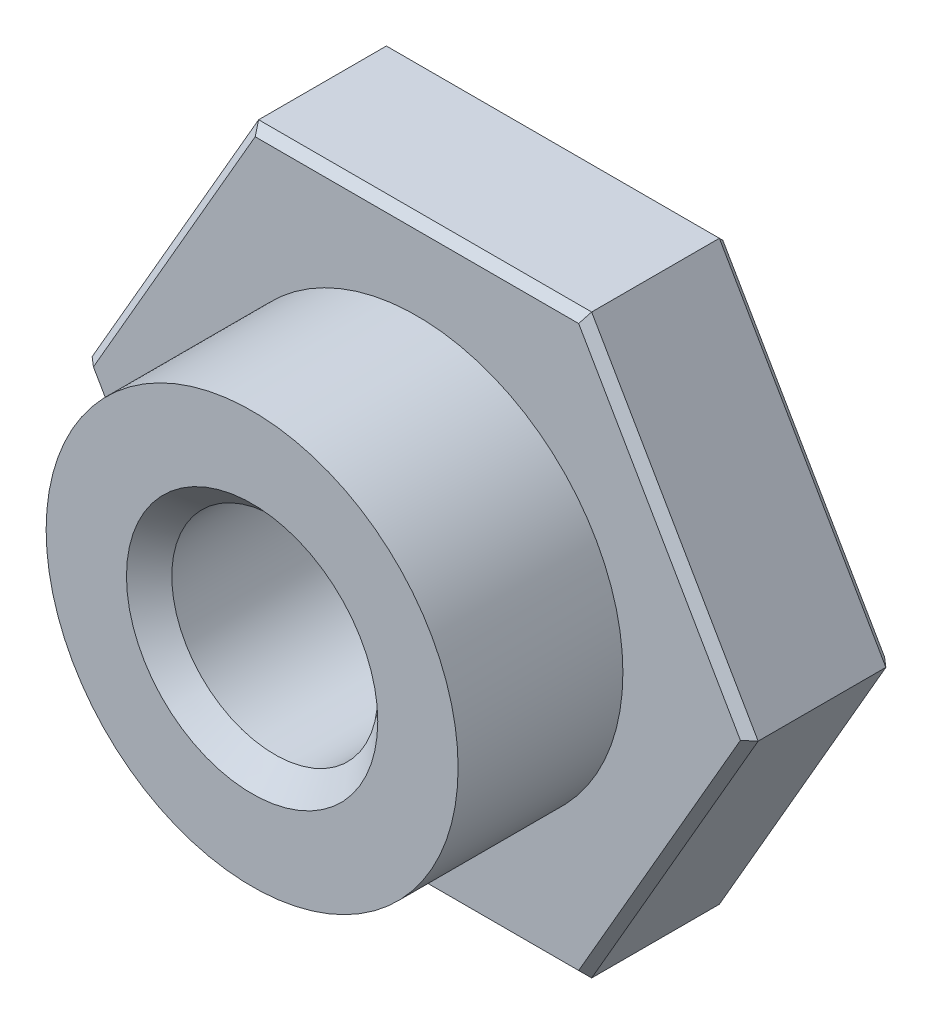
ISO-10303-21;
HEADER;
FILE_DESCRIPTION(('STEP AP214'),'2;1');
FILE_NAME('part.step','',(''),(''),'','','');
FILE_SCHEMA(('AUTOMOTIVE_DESIGN { 1 0 10303 214 1 1 1 1 }'));
ENDSEC;
DATA;
#1=APPLICATION_CONTEXT('core data for automotive mechanical design processes');
#2=APPLICATION_PROTOCOL_DEFINITION('international standard','automotive_design',2000,#1);
#3=PRODUCT_CONTEXT('',#1,'mechanical');
#4=PRODUCT('Part','Part','',(#3));
#5=PRODUCT_RELATED_PRODUCT_CATEGORY('part','',(#4));
#6=PRODUCT_DEFINITION_FORMATION('','',#4);
#7=PRODUCT_DEFINITION_CONTEXT('part definition',#1,'design');
#8=PRODUCT_DEFINITION('design','',#6,#7);
#9=PRODUCT_DEFINITION_SHAPE('','',#8);
#10=(LENGTH_UNIT() NAMED_UNIT(*) SI_UNIT(.MILLI.,.METRE.));
#11=(NAMED_UNIT(*) PLANE_ANGLE_UNIT() SI_UNIT($,.RADIAN.));
#12=(NAMED_UNIT(*) SI_UNIT($,.STERADIAN.) SOLID_ANGLE_UNIT());
#13=UNCERTAINTY_MEASURE_WITH_UNIT(LENGTH_MEASURE(1.E-05),#10,'distance_accuracy_value','');
#14=(GEOMETRIC_REPRESENTATION_CONTEXT(3) GLOBAL_UNCERTAINTY_ASSIGNED_CONTEXT((#13)) GLOBAL_UNIT_ASSIGNED_CONTEXT((#10,
#11,#12)) REPRESENTATION_CONTEXT('',''));
#15=CARTESIAN_POINT('',(0.,0.,0.));
#16=DIRECTION('',(0.,0.,1.));
#17=DIRECTION('',(1.,0.,0.));
#18=AXIS2_PLACEMENT_3D('',#15,#16,#17);
#19=CARTESIAN_POINT('',(0.,0.,3.75));
#20=DIRECTION('',(0.,0.,-1.));
#21=DIRECTION('',(-1.,0.,0.));
#22=AXIS2_PLACEMENT_3D('',#19,#20,#21);
#23=CYLINDRICAL_SURFACE('',#22,2.5);
#24=CARTESIAN_POINT('',(0.,0.,1.75));
#25=DIRECTION('',(0.,0.,-1.));
#26=DIRECTION('',(-1.,0.,0.));
#27=AXIS2_PLACEMENT_3D('',#24,#25,#26);
#28=CIRCLE('',#27,2.5);
#29=CARTESIAN_POINT('',(-2.5,0.,1.75));
#30=VERTEX_POINT('',#29);
#31=EDGE_CURVE('E20',#30,#30,#28,.T.);
#32=ORIENTED_EDGE('',*,*,#31,.F.);
#33=EDGE_LOOP('',(#32));
#34=FACE_BOUND('',#33,.T.);
#35=CARTESIAN_POINT('',(0.,0.,3.75));
#36=DIRECTION('',(0.,0.,-1.));
#37=DIRECTION('',(-1.,0.,0.));
#38=AXIS2_PLACEMENT_3D('',#35,#36,#37);
#39=CIRCLE('',#38,2.5);
#40=CARTESIAN_POINT('',(-2.5,0.,3.75));
#41=VERTEX_POINT('',#40);
#42=EDGE_CURVE('E117',#41,#41,#39,.F.);
#43=ORIENTED_EDGE('',*,*,#42,.F.);
#44=EDGE_LOOP('',(#43));
#45=FACE_BOUND('',#44,.T.);
#46=ADVANCED_FACE('F17',(#34,#45),#23,.T.);
#47=CARTESIAN_POINT('',(0.,0.,1.75));
#48=DIRECTION('',(0.,0.,1.));
#49=DIRECTION('',(1.,0.,0.));
#50=AXIS2_PLACEMENT_3D('',#47,#48,#49);
#51=PLANE('',#50);
#52=ORIENTED_EDGE('',*,*,#31,.T.);
#53=EDGE_LOOP('',(#52));
#54=FACE_BOUND('',#53,.T.);
#55=DIRECTION('',(1.,0.,0.));
#56=VECTOR('',#55,1.);
#57=CARTESIAN_POINT('',(0.,-3.4,1.75));
#58=LINE('',#57,#56);
#59=CARTESIAN_POINT('',(1.96299091524473,-3.4,1.75));
#60=VERTEX_POINT('',#59);
#61=CARTESIAN_POINT('',(-1.96299091524473,-3.4,1.75));
#62=VERTEX_POINT('',#61);
#63=EDGE_CURVE('E111',#60,#62,#58,.F.);
#64=ORIENTED_EDGE('',*,*,#63,.F.);
#65=DIRECTION('',(-0.5,-0.866025403784438,0.));
#66=VECTOR('',#65,1.);
#67=CARTESIAN_POINT('',(3.92598183048946,0.,1.75));
#68=LINE('',#67,#66);
#69=CARTESIAN_POINT('',(3.92598183048946,0.,1.75));
#70=VERTEX_POINT('',#69);
#71=EDGE_CURVE('E108',#70,#60,#68,.T.);
#72=ORIENTED_EDGE('',*,*,#71,.F.);
#73=DIRECTION('',(0.5,-0.866025403784439,0.));
#74=VECTOR('',#73,1.);
#75=CARTESIAN_POINT('',(1.96299091524473,3.4,1.75));
#76=LINE('',#75,#74);
#77=CARTESIAN_POINT('',(1.96299091524473,3.4,1.75));
#78=VERTEX_POINT('',#77);
#79=EDGE_CURVE('E105',#78,#70,#76,.T.);
#80=ORIENTED_EDGE('',*,*,#79,.F.);
#81=DIRECTION('',(1.,0.,0.));
#82=VECTOR('',#81,1.);
#83=CARTESIAN_POINT('',(0.,3.4,1.75));
#84=LINE('',#83,#82);
#85=CARTESIAN_POINT('',(-1.96299091524473,3.4,1.75));
#86=VERTEX_POINT('',#85);
#87=EDGE_CURVE('E271',#86,#78,#84,.T.);
#88=ORIENTED_EDGE('',*,*,#87,.F.);
#89=DIRECTION('',(0.5,0.866025403784439,0.));
#90=VECTOR('',#89,1.);
#91=CARTESIAN_POINT('',(-3.92598183048946,0.,1.75));
#92=LINE('',#91,#90);
#93=CARTESIAN_POINT('',(-3.92598183048946,0.,1.75));
#94=VERTEX_POINT('',#93);
#95=EDGE_CURVE('E269',#94,#86,#92,.T.);
#96=ORIENTED_EDGE('',*,*,#95,.F.);
#97=DIRECTION('',(-0.5,0.866025403784439,0.));
#98=VECTOR('',#97,1.);
#99=CARTESIAN_POINT('',(-1.96299091524473,-3.4,1.75));
#100=LINE('',#99,#98);
#101=EDGE_CURVE('E265',#62,#94,#100,.T.);
#102=ORIENTED_EDGE('',*,*,#101,.F.);
#103=EDGE_LOOP('',(#64,#72,#80,#88,#96,#102));
#104=FACE_BOUND('',#103,.T.);
#105=ADVANCED_FACE('F109',(#54,#104),#51,.T.);
#106=CARTESIAN_POINT('',(0.,0.,3.75));
#107=DIRECTION('',(0.,0.,1.));
#108=DIRECTION('',(1.,0.,0.));
#109=AXIS2_PLACEMENT_3D('',#106,#107,#108);
#110=PLANE('',#109);
#111=ORIENTED_EDGE('',*,*,#42,.T.);
#112=EDGE_LOOP('',(#111));
#113=FACE_BOUND('',#112,.T.);
#114=CARTESIAN_POINT('',(0.,0.,3.74999999996817));
#115=DIRECTION('',(0.,0.,1.));
#116=DIRECTION('',(1.,0.,0.));
#117=AXIS2_PLACEMENT_3D('',#114,#115,#116);
#118=CIRCLE('',#117,1.52499999995825);
#119=CARTESIAN_POINT('',(1.52499999995825,0.,3.74999999996817));
#120=VERTEX_POINT('',#119);
#121=EDGE_CURVE('E133',#120,#120,#118,.F.);
#122=ORIENTED_EDGE('',*,*,#121,.T.);
#123=EDGE_LOOP('',(#122));
#124=FACE_BOUND('',#123,.T.);
#125=ADVANCED_FACE('F148',(#113,#124),#110,.T.);
#126=CARTESIAN_POINT('',(2.94448637286709,-1.7,1.75));
#127=DIRECTION('',(0.612372435695797,-0.353553390593275,0.707106781186545));
#128=DIRECTION('',(0.755928946018452,0.,-0.65465367070798));
#129=AXIS2_PLACEMENT_3D('',#126,#127,#128);
#130=PLANE('',#129);
#131=DIRECTION('',(0.75592894601845,0.,-0.654653670707982));
#132=VECTOR('',#131,1.);
#133=CARTESIAN_POINT('',(3.36512728327668,0.,2.23571428571429));
#134=LINE('',#133,#132);
#135=CARTESIAN_POINT('',(4.04145188432738,0.,1.65));
#136=VERTEX_POINT('',#135);
#137=EDGE_CURVE('E116',#70,#136,#134,.T.);
#138=ORIENTED_EDGE('',*,*,#137,.F.);
#139=ORIENTED_EDGE('',*,*,#71,.T.);
#140=DIRECTION('',(-0.377964473009232,0.654653670707973,0.654653670707978));
#141=VECTOR('',#140,1.);
#142=CARTESIAN_POINT('',(2.02072594216369,-3.5,1.65));
#143=LINE('',#142,#141);
#144=CARTESIAN_POINT('',(2.02072594216369,-3.5,1.65));
#145=VERTEX_POINT('',#144);
#146=EDGE_CURVE('E259',#145,#60,#143,.T.);
#147=ORIENTED_EDGE('',*,*,#146,.F.);
#148=DIRECTION('',(-0.5,-0.866025403784439,0.));
#149=VECTOR('',#148,1.);
#150=CARTESIAN_POINT('',(2.02072594216369,-3.5,1.65));
#151=LINE('',#150,#149);
#152=EDGE_CURVE('E128',#145,#136,#151,.F.);
#153=ORIENTED_EDGE('',*,*,#152,.T.);
#154=EDGE_LOOP('',(#138,#139,#147,#153));
#155=FACE_BOUND('',#154,.T.);
#156=ADVANCED_FACE('F127',(#155),#130,.T.);
#157=CARTESIAN_POINT('',(2.94448637286709,1.7,1.75));
#158=DIRECTION('',(0.612372435695799,0.353553390593276,0.707106781186543));
#159=DIRECTION('',(0.75592894601845,0.,-0.654653670707982));
#160=AXIS2_PLACEMENT_3D('',#157,#158,#159);
#161=PLANE('',#160);
#162=DIRECTION('',(0.377964473009223,0.654653670707976,-0.654653670707981));
#163=VECTOR('',#162,1.);
#164=CARTESIAN_POINT('',(1.96299091524473,3.4,1.75));
#165=LINE('',#164,#163);
#166=CARTESIAN_POINT('',(2.02072594216369,3.5,1.65));
#167=VERTEX_POINT('',#166);
#168=EDGE_CURVE('E124',#78,#167,#165,.T.);
#169=ORIENTED_EDGE('',*,*,#168,.F.);
#170=ORIENTED_EDGE('',*,*,#79,.T.);
#171=ORIENTED_EDGE('',*,*,#137,.T.);
#172=DIRECTION('',(0.5,-0.866025403784439,0.));
#173=VECTOR('',#172,1.);
#174=CARTESIAN_POINT('',(4.04145188432738,0.,1.65));
#175=LINE('',#174,#173);
#176=EDGE_CURVE('E284',#136,#167,#175,.F.);
#177=ORIENTED_EDGE('',*,*,#176,.T.);
#178=EDGE_LOOP('',(#169,#170,#171,#177));
#179=FACE_BOUND('',#178,.T.);
#180=ADVANCED_FACE('F121',(#179),#161,.T.);
#181=CARTESIAN_POINT('',(0.,3.4,1.75));
#182=DIRECTION('',(0.,0.707106781186551,0.707106781186544));
#183=DIRECTION('',(0.,-0.707106781186544,0.707106781186551));
#184=AXIS2_PLACEMENT_3D('',#181,#182,#183);
#185=PLANE('',#184);
#186=DIRECTION('',(-0.377964473009226,0.654653670707975,-0.65465367070798));
#187=VECTOR('',#186,1.);
#188=CARTESIAN_POINT('',(-1.96299091524473,3.4,1.75));
#189=LINE('',#188,#187);
#190=CARTESIAN_POINT('',(-2.02072594216369,3.5,1.65));
#191=VERTEX_POINT('',#190);
#192=EDGE_CURVE('E267',#86,#191,#189,.T.);
#193=ORIENTED_EDGE('',*,*,#192,.F.);
#194=ORIENTED_EDGE('',*,*,#87,.T.);
#195=ORIENTED_EDGE('',*,*,#168,.T.);
#196=DIRECTION('',(1.,0.,0.));
#197=VECTOR('',#196,1.);
#198=CARTESIAN_POINT('',(2.02072594216369,3.5,1.65));
#199=LINE('',#198,#197);
#200=EDGE_CURVE('E275',#167,#191,#199,.F.);
#201=ORIENTED_EDGE('',*,*,#200,.T.);
#202=EDGE_LOOP('',(#193,#194,#195,#201));
#203=FACE_BOUND('',#202,.T.);
#204=ADVANCED_FACE('F228',(#203),#185,.T.);
#205=CARTESIAN_POINT('',(-2.94448637286709,1.7,1.75));
#206=DIRECTION('',(-0.612372435695797,0.353553390593276,0.707106781186544));
#207=DIRECTION('',(0.755928946018451,0.,0.654653670707981));
#208=AXIS2_PLACEMENT_3D('',#205,#206,#207);
#209=PLANE('',#208);
#210=ORIENTED_EDGE('',*,*,#192,.T.);
#211=DIRECTION('',(0.5,0.866025403784439,0.));
#212=VECTOR('',#211,1.);
#213=CARTESIAN_POINT('',(-2.02072594216369,3.5,1.65));
#214=LINE('',#213,#212);
#215=CARTESIAN_POINT('',(-4.04145188432738,0.,1.65));
#216=VERTEX_POINT('',#215);
#217=EDGE_CURVE('E288',#191,#216,#214,.F.);
#218=ORIENTED_EDGE('',*,*,#217,.T.);
#219=DIRECTION('',(0.755928946018453,0.,0.65465367070798));
#220=VECTOR('',#219,1.);
#221=CARTESIAN_POINT('',(-3.36512728327668,0.,2.23571428571429));
#222=LINE('',#221,#220);
#223=EDGE_CURVE('E263',#94,#216,#222,.F.);
#224=ORIENTED_EDGE('',*,*,#223,.F.);
#225=ORIENTED_EDGE('',*,*,#95,.T.);
#226=EDGE_LOOP('',(#210,#218,#224,#225));
#227=FACE_BOUND('',#226,.T.);
#228=ADVANCED_FACE('F224',(#227),#209,.T.);
#229=CARTESIAN_POINT('',(-2.94448637286709,-1.7,1.75));
#230=DIRECTION('',(-0.612372435695797,-0.353553390593275,0.707106781186545));
#231=DIRECTION('',(0.755928946018453,0.,0.65465367070798));
#232=AXIS2_PLACEMENT_3D('',#229,#230,#231);
#233=PLANE('',#232);
#234=ORIENTED_EDGE('',*,*,#223,.T.);
#235=DIRECTION('',(-0.5,0.866025403784439,0.));
#236=VECTOR('',#235,1.);
#237=CARTESIAN_POINT('',(-4.04145188432738,0.,1.65));
#238=LINE('',#237,#236);
#239=CARTESIAN_POINT('',(-2.02072594216369,-3.5,1.65));
#240=VERTEX_POINT('',#239);
#241=EDGE_CURVE('E317',#216,#240,#238,.F.);
#242=ORIENTED_EDGE('',*,*,#241,.T.);
#243=DIRECTION('',(-0.37796447300923,-0.654653670707973,-0.654653670707979));
#244=VECTOR('',#243,1.);
#245=CARTESIAN_POINT('',(-1.96299091524473,-3.4,1.75));
#246=LINE('',#245,#244);
#247=EDGE_CURVE('E261',#62,#240,#246,.T.);
#248=ORIENTED_EDGE('',*,*,#247,.F.);
#249=ORIENTED_EDGE('',*,*,#101,.T.);
#250=EDGE_LOOP('',(#234,#242,#248,#249));
#251=FACE_BOUND('',#250,.T.);
#252=ADVANCED_FACE('F220',(#251),#233,.T.);
#253=CARTESIAN_POINT('',(0.,-3.4,1.75));
#254=DIRECTION('',(0.,-0.707106781186551,0.707106781186544));
#255=DIRECTION('',(0.,-0.707106781186544,-0.707106781186551));
#256=AXIS2_PLACEMENT_3D('',#253,#254,#255);
#257=PLANE('',#256);
#258=ORIENTED_EDGE('',*,*,#146,.T.);
#259=ORIENTED_EDGE('',*,*,#63,.T.);
#260=ORIENTED_EDGE('',*,*,#247,.T.);
#261=DIRECTION('',(-1.,0.,0.));
#262=VECTOR('',#261,1.);
#263=CARTESIAN_POINT('',(-2.02072594216369,-3.5,1.65));
#264=LINE('',#263,#262);
#265=EDGE_CURVE('E311',#240,#145,#264,.F.);
#266=ORIENTED_EDGE('',*,*,#265,.T.);
#267=EDGE_LOOP('',(#258,#259,#260,#266));
#268=FACE_BOUND('',#267,.T.);
#269=ADVANCED_FACE('F216',(#268),#257,.T.);
#270=CARTESIAN_POINT('',(0.,0.,3.74999999991132));
#271=DIRECTION('',(0.,0.,1.));
#272=DIRECTION('',(1.,0.,0.));
#273=AXIS2_PLACEMENT_3D('',#270,#271,#272);
#274=CONICAL_SURFACE('',#273,1.52499999990141,0.785398163397448);
#275=ORIENTED_EDGE('',*,*,#121,.F.);
#276=EDGE_LOOP('',(#275));
#277=FACE_BOUND('',#276,.T.);
#278=CARTESIAN_POINT('',(0.,0.,3.47499999999999));
#279=DIRECTION('',(0.,0.,1.));
#280=DIRECTION('',(1.,0.,0.));
#281=AXIS2_PLACEMENT_3D('',#278,#279,#280);
#282=CIRCLE('',#281,1.24999999999999);
#283=CARTESIAN_POINT('',(1.24999999999999,0.,3.47499999999999));
#284=VERTEX_POINT('',#283);
#285=EDGE_CURVE('E245',#284,#284,#282,.F.);
#286=ORIENTED_EDGE('',*,*,#285,.T.);
#287=EDGE_LOOP('',(#286));
#288=FACE_BOUND('',#287,.T.);
#289=ADVANCED_FACE('F212',(#277,#288),#274,.F.);
#290=CARTESIAN_POINT('',(2.02072594216369,-3.5,1.75));
#291=DIRECTION('',(-0.866025403784439,0.5,0.));
#292=DIRECTION('',(-0.5,-0.866025403784439,0.));
#293=AXIS2_PLACEMENT_3D('',#290,#291,#292);
#294=PLANE('',#293);
#295=DIRECTION('',(0.5,0.866025403784438,0.));
#296=VECTOR('',#295,1.);
#297=CARTESIAN_POINT('',(2.02072594216369,-3.5,0.0999999999999994));
#298=LINE('',#297,#296);
#299=CARTESIAN_POINT('',(2.02072594216369,-3.5,0.0999999999999989));
#300=VERTEX_POINT('',#299);
#301=CARTESIAN_POINT('',(4.04145188432738,0.,0.0999999999999991));
#302=VERTEX_POINT('',#301);
#303=EDGE_CURVE('E246',#300,#302,#298,.T.);
#304=ORIENTED_EDGE('',*,*,#303,.T.);
#305=DIRECTION('',(0.,0.,1.));
#306=VECTOR('',#305,1.);
#307=CARTESIAN_POINT('',(4.04145188432738,0.,1.75));
#308=LINE('',#307,#306);
#309=EDGE_CURVE('E282',#302,#136,#308,.T.);
#310=ORIENTED_EDGE('',*,*,#309,.T.);
#311=ORIENTED_EDGE('',*,*,#152,.F.);
#312=DIRECTION('',(0.,0.,1.));
#313=VECTOR('',#312,1.);
#314=CARTESIAN_POINT('',(2.02072594216369,-3.5,1.75));
#315=LINE('',#314,#313);
#316=EDGE_CURVE('E253',#145,#300,#315,.F.);
#317=ORIENTED_EDGE('',*,*,#316,.T.);
#318=EDGE_LOOP('',(#304,#310,#311,#317));
#319=FACE_BOUND('',#318,.T.);
#320=ADVANCED_FACE('F208',(#319),#294,.F.);
#321=CARTESIAN_POINT('',(4.04145188432738,0.,1.75));
#322=DIRECTION('',(-0.866025403784439,-0.5,0.));
#323=DIRECTION('',(0.5,-0.866025403784439,0.));
#324=AXIS2_PLACEMENT_3D('',#321,#322,#323);
#325=PLANE('',#324);
#326=DIRECTION('',(-0.5,0.866025403784439,0.));
#327=VECTOR('',#326,1.);
#328=CARTESIAN_POINT('',(4.04145188432738,0.,0.0999999999999994));
#329=LINE('',#328,#327);
#330=CARTESIAN_POINT('',(2.02072594216369,3.5,0.0999999999999994));
#331=VERTEX_POINT('',#330);
#332=EDGE_CURVE('E250',#302,#331,#329,.T.);
#333=ORIENTED_EDGE('',*,*,#332,.T.);
#334=DIRECTION('',(0.,0.,-1.));
#335=VECTOR('',#334,1.);
#336=CARTESIAN_POINT('',(2.02072594216369,3.5,1.75));
#337=LINE('',#336,#335);
#338=EDGE_CURVE('E279',#331,#167,#337,.F.);
#339=ORIENTED_EDGE('',*,*,#338,.T.);
#340=ORIENTED_EDGE('',*,*,#176,.F.);
#341=ORIENTED_EDGE('',*,*,#309,.F.);
#342=EDGE_LOOP('',(#333,#339,#340,#341));
#343=FACE_BOUND('',#342,.T.);
#344=ADVANCED_FACE('F204',(#343),#325,.F.);
#345=CARTESIAN_POINT('',(2.02072594216369,3.5,1.75));
#346=DIRECTION('',(0.,-1.,0.));
#347=DIRECTION('',(0.,0.,-1.));
#348=AXIS2_PLACEMENT_3D('',#345,#346,#347);
#349=PLANE('',#348);
#350=DIRECTION('',(1.,0.,0.));
#351=VECTOR('',#350,1.);
#352=CARTESIAN_POINT('',(2.02072594216369,3.5,0.0999999999999994));
#353=LINE('',#352,#351);
#354=CARTESIAN_POINT('',(-2.02072594216369,3.5,0.0999999999999991));
#355=VERTEX_POINT('',#354);
#356=EDGE_CURVE('E301',#331,#355,#353,.F.);
#357=ORIENTED_EDGE('',*,*,#356,.T.);
#358=DIRECTION('',(0.,0.,1.));
#359=VECTOR('',#358,1.);
#360=CARTESIAN_POINT('',(-2.02072594216369,3.5,1.75));
#361=LINE('',#360,#359);
#362=EDGE_CURVE('E281',#355,#191,#361,.T.);
#363=ORIENTED_EDGE('',*,*,#362,.T.);
#364=ORIENTED_EDGE('',*,*,#200,.F.);
#365=ORIENTED_EDGE('',*,*,#338,.F.);
#366=EDGE_LOOP('',(#357,#363,#364,#365));
#367=FACE_BOUND('',#366,.T.);
#368=ADVANCED_FACE('F200',(#367),#349,.F.);
#369=CARTESIAN_POINT('',(-2.02072594216369,3.5,1.75));
#370=DIRECTION('',(0.866025403784439,-0.5,0.));
#371=DIRECTION('',(0.5,0.866025403784439,0.));
#372=AXIS2_PLACEMENT_3D('',#369,#370,#371);
#373=PLANE('',#372);
#374=DIRECTION('',(-0.5,-0.866025403784438,0.));
#375=VECTOR('',#374,1.);
#376=CARTESIAN_POINT('',(-2.02072594216369,3.5,0.0999999999999994));
#377=LINE('',#376,#375);
#378=CARTESIAN_POINT('',(-4.04145188432738,0.,0.0999999999999991));
#379=VERTEX_POINT('',#378);
#380=EDGE_CURVE('E345',#355,#379,#377,.T.);
#381=ORIENTED_EDGE('',*,*,#380,.T.);
#382=DIRECTION('',(0.,0.,1.));
#383=VECTOR('',#382,1.);
#384=CARTESIAN_POINT('',(-4.04145188432738,0.,1.75));
#385=LINE('',#384,#383);
#386=EDGE_CURVE('E314',#379,#216,#385,.T.);
#387=ORIENTED_EDGE('',*,*,#386,.T.);
#388=ORIENTED_EDGE('',*,*,#217,.F.);
#389=ORIENTED_EDGE('',*,*,#362,.F.);
#390=EDGE_LOOP('',(#381,#387,#388,#389));
#391=FACE_BOUND('',#390,.T.);
#392=ADVANCED_FACE('F196',(#391),#373,.F.);
#393=CARTESIAN_POINT('',(-4.04145188432738,0.,1.75));
#394=DIRECTION('',(0.866025403784439,0.5,0.));
#395=DIRECTION('',(-0.5,0.866025403784439,0.));
#396=AXIS2_PLACEMENT_3D('',#393,#394,#395);
#397=PLANE('',#396);
#398=DIRECTION('',(0.5,-0.866025403784439,0.));
#399=VECTOR('',#398,1.);
#400=CARTESIAN_POINT('',(-4.04145188432738,0.,0.0999999999999994));
#401=LINE('',#400,#399);
#402=CARTESIAN_POINT('',(-2.02072594216369,-3.5,0.0999999999999994));
#403=VERTEX_POINT('',#402);
#404=EDGE_CURVE('E324',#379,#403,#401,.T.);
#405=ORIENTED_EDGE('',*,*,#404,.T.);
#406=DIRECTION('',(0.,0.,1.));
#407=VECTOR('',#406,1.);
#408=CARTESIAN_POINT('',(-2.02072594216369,-3.5,1.75));
#409=LINE('',#408,#407);
#410=EDGE_CURVE('E247',#403,#240,#409,.T.);
#411=ORIENTED_EDGE('',*,*,#410,.T.);
#412=ORIENTED_EDGE('',*,*,#241,.F.);
#413=ORIENTED_EDGE('',*,*,#386,.F.);
#414=EDGE_LOOP('',(#405,#411,#412,#413));
#415=FACE_BOUND('',#414,.T.);
#416=ADVANCED_FACE('F192',(#415),#397,.F.);
#417=CARTESIAN_POINT('',(-2.02072594216369,-3.5,1.75));
#418=DIRECTION('',(0.,1.,0.));
#419=DIRECTION('',(-1.,0.,0.));
#420=AXIS2_PLACEMENT_3D('',#417,#418,#419);
#421=PLANE('',#420);
#422=DIRECTION('',(1.,0.,0.));
#423=VECTOR('',#422,1.);
#424=CARTESIAN_POINT('',(-2.02072594216369,-3.5,0.0999999999999994));
#425=LINE('',#424,#423);
#426=EDGE_CURVE('E328',#403,#300,#425,.T.);
#427=ORIENTED_EDGE('',*,*,#426,.T.);
#428=ORIENTED_EDGE('',*,*,#316,.F.);
#429=ORIENTED_EDGE('',*,*,#265,.F.);
#430=ORIENTED_EDGE('',*,*,#410,.F.);
#431=EDGE_LOOP('',(#427,#428,#429,#430));
#432=FACE_BOUND('',#431,.T.);
#433=ADVANCED_FACE('F188',(#432),#421,.F.);
#434=CARTESIAN_POINT('',(0.,0.,3.75));
#435=DIRECTION('',(0.,0.,1.));
#436=DIRECTION('',(1.,0.,0.));
#437=AXIS2_PLACEMENT_3D('',#434,#435,#436);
#438=CYLINDRICAL_SURFACE('',#437,1.24999999999999);
#439=ORIENTED_EDGE('',*,*,#285,.F.);
#440=EDGE_LOOP('',(#439));
#441=FACE_BOUND('',#440,.T.);
#442=CARTESIAN_POINT('',(0.,0.,0.275000000044656));
#443=DIRECTION('',(0.,0.,-1.));
#444=DIRECTION('',(-1.,0.,0.));
#445=AXIS2_PLACEMENT_3D('',#442,#443,#444);
#446=CIRCLE('',#445,1.25000000002728);
#447=CARTESIAN_POINT('',(-1.25000000002728,0.,0.275000000044656));
#448=VERTEX_POINT('',#447);
#449=EDGE_CURVE('E305',#448,#448,#446,.T.);
#450=ORIENTED_EDGE('',*,*,#449,.T.);
#451=EDGE_LOOP('',(#450));
#452=FACE_BOUND('',#451,.T.);
#453=ADVANCED_FACE('F184',(#441,#452),#438,.F.);
#454=CARTESIAN_POINT('',(2.02072594216369,-3.5,0.0999999999999994));
#455=DIRECTION('',(-0.612372435695794,0.353553390593274,0.707106781186547));
#456=DIRECTION('',(0.755928946018454,0.,0.654653670707977));
#457=AXIS2_PLACEMENT_3D('',#454,#455,#456);
#458=PLANE('',#457);
#459=ORIENTED_EDGE('',*,*,#303,.F.);
#460=DIRECTION('',(-0.377964473009233,0.654653670707975,-0.654653670707975));
#461=VECTOR('',#460,1.);
#462=CARTESIAN_POINT('',(2.02072594216369,-3.5,0.0999999999999994));
#463=LINE('',#462,#461);
#464=CARTESIAN_POINT('',(1.96299091524473,-3.4,0.));
#465=VERTEX_POINT('',#464);
#466=EDGE_CURVE('E308',#300,#465,#463,.T.);
#467=ORIENTED_EDGE('',*,*,#466,.T.);
#468=DIRECTION('',(0.5,0.866025403784438,0.));
#469=VECTOR('',#468,1.);
#470=CARTESIAN_POINT('',(1.96299091524473,-3.4,0.));
#471=LINE('',#470,#469);
#472=CARTESIAN_POINT('',(3.92598183048946,0.,0.));
#473=VERTEX_POINT('',#472);
#474=EDGE_CURVE('E307',#465,#473,#471,.T.);
#475=ORIENTED_EDGE('',*,*,#474,.T.);
#476=DIRECTION('',(0.755928946018455,0.,0.654653670707977));
#477=VECTOR('',#476,1.);
#478=CARTESIAN_POINT('',(4.04145188432738,0.,0.0999999999999994));
#479=LINE('',#478,#477);
#480=EDGE_CURVE('E297',#473,#302,#479,.T.);
#481=ORIENTED_EDGE('',*,*,#480,.T.);
#482=EDGE_LOOP('',(#459,#467,#475,#481));
#483=FACE_BOUND('',#482,.T.);
#484=ADVANCED_FACE('F180',(#483),#458,.F.);
#485=CARTESIAN_POINT('',(4.04145188432738,0.,0.0999999999999994));
#486=DIRECTION('',(-0.612372435695794,-0.353553390593274,0.707106781186548));
#487=DIRECTION('',(0.755928946018455,0.,0.654653670707977));
#488=AXIS2_PLACEMENT_3D('',#485,#486,#487);
#489=PLANE('',#488);
#490=DIRECTION('',(-0.5,0.866025403784439,0.));
#491=VECTOR('',#490,1.);
#492=CARTESIAN_POINT('',(3.92598183048946,0.,0.));
#493=LINE('',#492,#491);
#494=CARTESIAN_POINT('',(1.96299091524473,3.4,0.));
#495=VERTEX_POINT('',#494);
#496=EDGE_CURVE('E360',#473,#495,#493,.T.);
#497=ORIENTED_EDGE('',*,*,#496,.T.);
#498=DIRECTION('',(0.377964473009226,0.654653670707978,0.654653670707977));
#499=VECTOR('',#498,1.);
#500=CARTESIAN_POINT('',(1.96299091524473,3.4,0.));
#501=LINE('',#500,#499);
#502=EDGE_CURVE('E299',#495,#331,#501,.T.);
#503=ORIENTED_EDGE('',*,*,#502,.T.);
#504=ORIENTED_EDGE('',*,*,#332,.F.);
#505=ORIENTED_EDGE('',*,*,#480,.F.);
#506=EDGE_LOOP('',(#497,#503,#504,#505));
#507=FACE_BOUND('',#506,.T.);
#508=ADVANCED_FACE('F176',(#507),#489,.F.);
#509=CARTESIAN_POINT('',(2.02072594216369,3.5,0.0999999999999994));
#510=DIRECTION('',(0.,-0.707106781186548,0.707106781186548));
#511=DIRECTION('',(0.,-0.707106781186548,-0.707106781186548));
#512=AXIS2_PLACEMENT_3D('',#509,#510,#511);
#513=PLANE('',#512);
#514=DIRECTION('',(1.,0.,0.));
#515=VECTOR('',#514,1.);
#516=CARTESIAN_POINT('',(0.,3.4,0.));
#517=LINE('',#516,#515);
#518=CARTESIAN_POINT('',(-1.96299091524473,3.4,0.));
#519=VERTEX_POINT('',#518);
#520=EDGE_CURVE('E350',#495,#519,#517,.F.);
#521=ORIENTED_EDGE('',*,*,#520,.T.);
#522=DIRECTION('',(-0.377964473009231,0.654653670707974,0.654653670707978));
#523=VECTOR('',#522,1.);
#524=CARTESIAN_POINT('',(-1.96299091524473,3.4,0.));
#525=LINE('',#524,#523);
#526=EDGE_CURVE('E342',#519,#355,#525,.T.);
#527=ORIENTED_EDGE('',*,*,#526,.T.);
#528=ORIENTED_EDGE('',*,*,#356,.F.);
#529=ORIENTED_EDGE('',*,*,#502,.F.);
#530=EDGE_LOOP('',(#521,#527,#528,#529));
#531=FACE_BOUND('',#530,.T.);
#532=ADVANCED_FACE('F172',(#531),#513,.F.);
#533=CARTESIAN_POINT('',(-2.02072594216369,3.5,0.0999999999999994));
#534=DIRECTION('',(0.612372435695794,-0.353553390593274,0.707106781186547));
#535=DIRECTION('',(0.755928946018454,0.,-0.654653670707977));
#536=AXIS2_PLACEMENT_3D('',#533,#534,#535);
#537=PLANE('',#536);
#538=DIRECTION('',(-0.5,-0.866025403784439,0.));
#539=VECTOR('',#538,1.);
#540=CARTESIAN_POINT('',(-1.96299091524473,3.4,0.));
#541=LINE('',#540,#539);
#542=CARTESIAN_POINT('',(-3.92598183048946,0.,0.));
#543=VERTEX_POINT('',#542);
#544=EDGE_CURVE('E354',#519,#543,#541,.T.);
#545=ORIENTED_EDGE('',*,*,#544,.T.);
#546=DIRECTION('',(0.755928946018454,0.,-0.654653670707978));
#547=VECTOR('',#546,1.);
#548=CARTESIAN_POINT('',(-4.04145188432738,0.,0.0999999999999995));
#549=LINE('',#548,#547);
#550=EDGE_CURVE('E338',#543,#379,#549,.F.);
#551=ORIENTED_EDGE('',*,*,#550,.T.);
#552=ORIENTED_EDGE('',*,*,#380,.F.);
#553=ORIENTED_EDGE('',*,*,#526,.F.);
#554=EDGE_LOOP('',(#545,#551,#552,#553));
#555=FACE_BOUND('',#554,.T.);
#556=ADVANCED_FACE('F168',(#555),#537,.F.);
#557=CARTESIAN_POINT('',(-4.04145188432738,0.,0.0999999999999994));
#558=DIRECTION('',(0.612372435695795,0.353553390593274,0.707106781186547));
#559=DIRECTION('',(0.755928946018454,0.,-0.654653670707978));
#560=AXIS2_PLACEMENT_3D('',#557,#558,#559);
#561=PLANE('',#560);
#562=DIRECTION('',(0.5,-0.866025403784439,0.));
#563=VECTOR('',#562,1.);
#564=CARTESIAN_POINT('',(-3.92598183048946,0.,0.));
#565=LINE('',#564,#563);
#566=CARTESIAN_POINT('',(-1.96299091524473,-3.4,0.));
#567=VERTEX_POINT('',#566);
#568=EDGE_CURVE('E357',#543,#567,#565,.T.);
#569=ORIENTED_EDGE('',*,*,#568,.T.);
#570=DIRECTION('',(-0.377964473009228,-0.654653670707977,0.654653670707977));
#571=VECTOR('',#570,1.);
#572=CARTESIAN_POINT('',(-1.96299091524473,-3.4,0.));
#573=LINE('',#572,#571);
#574=EDGE_CURVE('E35',#567,#403,#573,.T.);
#575=ORIENTED_EDGE('',*,*,#574,.T.);
#576=ORIENTED_EDGE('',*,*,#404,.F.);
#577=ORIENTED_EDGE('',*,*,#550,.F.);
#578=EDGE_LOOP('',(#569,#575,#576,#577));
#579=FACE_BOUND('',#578,.T.);
#580=ADVANCED_FACE('F165',(#579),#561,.F.);
#581=CARTESIAN_POINT('',(-2.02072594216369,-3.5,0.0999999999999994));
#582=DIRECTION('',(0.,0.707106781186548,0.707106781186548));
#583=DIRECTION('',(0.,-0.707106781186548,0.707106781186548));
#584=AXIS2_PLACEMENT_3D('',#581,#582,#583);
#585=PLANE('',#584);
#586=ORIENTED_EDGE('',*,*,#426,.F.);
#587=ORIENTED_EDGE('',*,*,#574,.F.);
#588=DIRECTION('',(1.,0.,0.));
#589=VECTOR('',#588,1.);
#590=CARTESIAN_POINT('',(0.,-3.4,0.));
#591=LINE('',#590,#589);
#592=EDGE_CURVE('E26',#567,#465,#591,.T.);
#593=ORIENTED_EDGE('',*,*,#592,.T.);
#594=ORIENTED_EDGE('',*,*,#466,.F.);
#595=EDGE_LOOP('',(#586,#587,#593,#594));
#596=FACE_BOUND('',#595,.T.);
#597=ADVANCED_FACE('F157',(#596),#585,.F.);
#598=CARTESIAN_POINT('',(0.,0.,5.6843418860808E-11));
#599=DIRECTION('',(0.,0.,-1.));
#600=DIRECTION('',(-1.,0.,0.));
#601=AXIS2_PLACEMENT_3D('',#598,#599,#600);
#602=CONICAL_SURFACE('',#601,1.5250000000151,0.785398163397448);
#603=CARTESIAN_POINT('',(0.,0.,5.6843418860808E-11));
#604=DIRECTION('',(0.,0.,-1.));
#605=DIRECTION('',(-1.,0.,0.));
#606=AXIS2_PLACEMENT_3D('',#603,#604,#605);
#607=CIRCLE('',#606,1.5250000000151);
#608=CARTESIAN_POINT('',(-1.5250000000151,0.,5.6843418860808E-11));
#609=VERTEX_POINT('',#608);
#610=EDGE_CURVE('E11',#609,#609,#607,.T.);
#611=ORIENTED_EDGE('',*,*,#610,.T.);
#612=EDGE_LOOP('',(#611));
#613=FACE_BOUND('',#612,.T.);
#614=ORIENTED_EDGE('',*,*,#449,.F.);
#615=EDGE_LOOP('',(#614));
#616=FACE_BOUND('',#615,.T.);
#617=ADVANCED_FACE('F151',(#613,#616),#602,.F.);
#618=CARTESIAN_POINT('',(0.,0.,0.));
#619=DIRECTION('',(0.,0.,1.));
#620=DIRECTION('',(1.,0.,0.));
#621=AXIS2_PLACEMENT_3D('',#618,#619,#620);
#622=PLANE('',#621);
#623=ORIENTED_EDGE('',*,*,#610,.F.);
#624=EDGE_LOOP('',(#623));
#625=FACE_BOUND('',#624,.T.);
#626=ORIENTED_EDGE('',*,*,#568,.F.);
#627=ORIENTED_EDGE('',*,*,#544,.F.);
#628=ORIENTED_EDGE('',*,*,#520,.F.);
#629=ORIENTED_EDGE('',*,*,#496,.F.);
#630=ORIENTED_EDGE('',*,*,#474,.F.);
#631=ORIENTED_EDGE('',*,*,#592,.F.);
#632=EDGE_LOOP('',(#626,#627,#628,#629,#630,#631));
#633=FACE_BOUND('',#632,.T.);
#634=ADVANCED_FACE('F149',(#625,#633),#622,.F.);
#635=CLOSED_SHELL('',(#46,#105,#125,#156,#180,#204,#228,#252,#269,#289,#320,#344,#368,#392,#416,
#433,#453,#484,#508,#532,#556,#580,#597,#617,#634));
#636=MANIFOLD_SOLID_BREP('B1',#635);
#637=ADVANCED_BREP_SHAPE_REPRESENTATION('',(#18,#636),#14);
#638=SHAPE_DEFINITION_REPRESENTATION(#9,#637);
ENDSEC;
END-ISO-10303-21;
